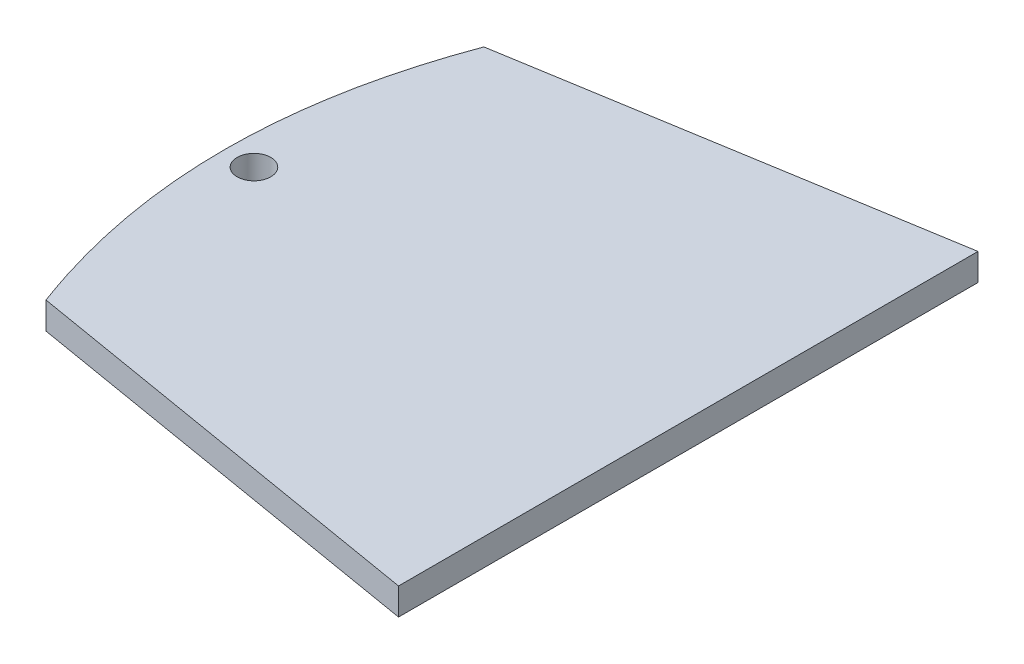
ISO-10303-21;
HEADER;
FILE_DESCRIPTION(('STEP AP214'),'2;1');
FILE_NAME('part.step','',(''),(''),'','','');
FILE_SCHEMA(('AUTOMOTIVE_DESIGN { 1 0 10303 214 1 1 1 1 }'));
ENDSEC;
DATA;
#1=APPLICATION_CONTEXT('core data for automotive mechanical design processes');
#2=APPLICATION_PROTOCOL_DEFINITION('international standard','automotive_design',2000,#1);
#3=PRODUCT_CONTEXT('',#1,'mechanical');
#4=PRODUCT('Part','Part','',(#3));
#5=PRODUCT_RELATED_PRODUCT_CATEGORY('part','',(#4));
#6=PRODUCT_DEFINITION_FORMATION('','',#4);
#7=PRODUCT_DEFINITION_CONTEXT('part definition',#1,'design');
#8=PRODUCT_DEFINITION('design','',#6,#7);
#9=PRODUCT_DEFINITION_SHAPE('','',#8);
#10=(LENGTH_UNIT() NAMED_UNIT(*) SI_UNIT(.MILLI.,.METRE.));
#11=(NAMED_UNIT(*) PLANE_ANGLE_UNIT() SI_UNIT($,.RADIAN.));
#12=(NAMED_UNIT(*) SI_UNIT($,.STERADIAN.) SOLID_ANGLE_UNIT());
#13=UNCERTAINTY_MEASURE_WITH_UNIT(LENGTH_MEASURE(1.E-05),#10,'distance_accuracy_value','');
#14=(GEOMETRIC_REPRESENTATION_CONTEXT(3) GLOBAL_UNCERTAINTY_ASSIGNED_CONTEXT((#13)) GLOBAL_UNIT_ASSIGNED_CONTEXT((#10,
#11,#12)) REPRESENTATION_CONTEXT('',''));
#15=CARTESIAN_POINT('',(0.,0.,0.));
#16=DIRECTION('',(0.,0.,1.));
#17=DIRECTION('',(1.,0.,0.));
#18=AXIS2_PLACEMENT_3D('',#15,#16,#17);
#19=CARTESIAN_POINT('',(-85.6517239552644,4.,-19.0315788004675));
#20=DIRECTION('',(0.,-1.,0.));
#21=DIRECTION('',(0.,0.,-1.));
#22=AXIS2_PLACEMENT_3D('',#19,#20,#21);
#23=PLANE('',#22);
#24=CARTESIAN_POINT('',(-79.6011786763253,4.,-51.5462335262357));
#25=CARTESIAN_POINT('',(-91.7198747328705,4.,-19.0283130118107));
#26=CARTESIAN_POINT('',(-79.5659676789912,4.,13.4765443479873));
#27=B_SPLINE_CURVE_WITH_KNOTS('',2,(#24,#25,#26),.UNSPECIFIED.,.F.,.F.,(3,3),(0.,1.),.UNSPECIFIED.);
#28=CARTESIAN_POINT('',(-79.6011786763253,4.,-51.5462335262357));
#29=VERTEX_POINT('',#28);
#30=CARTESIAN_POINT('',(-79.5659676789912,4.,13.4765443479873));
#31=VERTEX_POINT('',#30);
#32=EDGE_CURVE('E85',#29,#31,#27,.T.);
#33=ORIENTED_EDGE('',*,*,#32,.T.);
#34=DIRECTION('',(0.986116663206001,0.,0.16605398684603));
#35=VECTOR('',#34,1.);
#36=CARTESIAN_POINT('',(-16.6517245664483,4.,24.070788708764));
#37=LINE('',#36,#35);
#38=CARTESIAN_POINT('',(-16.6517245664483,4.,24.070788708764));
#39=VERTEX_POINT('',#38);
#40=EDGE_CURVE('E80',#31,#39,#37,.T.);
#41=ORIENTED_EDGE('',*,*,#40,.T.);
#42=DIRECTION('',(0.,0.,-1.));
#43=VECTOR('',#42,1.);
#44=CARTESIAN_POINT('',(-16.6517245664483,4.,-61.929211291236));
#45=LINE('',#44,#43);
#46=CARTESIAN_POINT('',(-16.6517245664483,4.,-61.929211291236));
#47=VERTEX_POINT('',#46);
#48=EDGE_CURVE('E83',#39,#47,#45,.T.);
#49=ORIENTED_EDGE('',*,*,#48,.T.);
#50=DIRECTION('',(-0.98666855971594,0.,0.162742598197496));
#51=VECTOR('',#50,1.);
#52=CARTESIAN_POINT('',(-79.6011786763253,4.,-51.5462335262357));
#53=LINE('',#52,#51);
#54=EDGE_CURVE('E50',#47,#29,#53,.T.);
#55=ORIENTED_EDGE('',*,*,#54,.T.);
#56=EDGE_LOOP('',(#33,#41,#49,#55));
#57=FACE_BOUND('',#56,.T.);
#58=CARTESIAN_POINT('',(-81.2125944381604,4.,-19.0327209291016));
#59=DIRECTION('',(0.,1.,0.));
#60=DIRECTION('',(0.,0.,1.));
#61=AXIS2_PLACEMENT_3D('',#58,#59,#60);
#62=CIRCLE('',#61,2.50000000000001);
#63=CARTESIAN_POINT('',(-81.2125944381604,4.,-16.5327209291016));
#64=VERTEX_POINT('',#63);
#65=EDGE_CURVE('E101',#64,#64,#62,.T.);
#66=ORIENTED_EDGE('',*,*,#65,.F.);
#67=EDGE_LOOP('',(#66));
#68=FACE_BOUND('',#67,.T.);
#69=ADVANCED_FACE('F32',(#57,#68),#23,.F.);
#70=CARTESIAN_POINT('',(-85.6517239552644,0.,-19.0315788004675));
#71=DIRECTION('',(0.,-1.,0.));
#72=DIRECTION('',(0.,0.,-1.));
#73=AXIS2_PLACEMENT_3D('',#70,#71,#72);
#74=PLANE('',#73);
#75=CARTESIAN_POINT('',(-79.6011786763253,0.,-51.5462335262357));
#76=CARTESIAN_POINT('',(-91.7198747328705,0.,-19.0283130118107));
#77=CARTESIAN_POINT('',(-79.5659676789912,0.,13.4765443479873));
#78=B_SPLINE_CURVE_WITH_KNOTS('',2,(#75,#76,#77),.UNSPECIFIED.,.F.,.F.,(3,3),(0.,1.),.UNSPECIFIED.);
#79=CARTESIAN_POINT('',(-79.6011786763253,0.,-51.5462335262357));
#80=VERTEX_POINT('',#79);
#81=CARTESIAN_POINT('',(-79.5659676789912,0.,13.4765443479873));
#82=VERTEX_POINT('',#81);
#83=EDGE_CURVE('E96',#80,#82,#78,.T.);
#84=ORIENTED_EDGE('',*,*,#83,.F.);
#85=DIRECTION('',(-0.98666855971594,0.,0.162742598197496));
#86=VECTOR('',#85,1.);
#87=CARTESIAN_POINT('',(-79.6011786763253,0.,-51.5462335262357));
#88=LINE('',#87,#86);
#89=CARTESIAN_POINT('',(-16.6517245664483,0.,-61.929211291236));
#90=VERTEX_POINT('',#89);
#91=EDGE_CURVE('E73',#90,#80,#88,.T.);
#92=ORIENTED_EDGE('',*,*,#91,.F.);
#93=DIRECTION('',(0.,0.,-1.));
#94=VECTOR('',#93,1.);
#95=CARTESIAN_POINT('',(-16.6517245664483,0.,-61.929211291236));
#96=LINE('',#95,#94);
#97=CARTESIAN_POINT('',(-16.6517245664483,0.,24.070788708764));
#98=VERTEX_POINT('',#97);
#99=EDGE_CURVE('E67',#98,#90,#96,.T.);
#100=ORIENTED_EDGE('',*,*,#99,.F.);
#101=DIRECTION('',(0.986116663206001,0.,0.16605398684603));
#102=VECTOR('',#101,1.);
#103=CARTESIAN_POINT('',(-16.6517245664483,0.,24.070788708764));
#104=LINE('',#103,#102);
#105=EDGE_CURVE('E89',#82,#98,#104,.T.);
#106=ORIENTED_EDGE('',*,*,#105,.F.);
#107=EDGE_LOOP('',(#84,#92,#100,#106));
#108=FACE_BOUND('',#107,.T.);
#109=CARTESIAN_POINT('',(-81.2125944381604,0.,-19.0327209291016));
#110=DIRECTION('',(0.,1.,0.));
#111=DIRECTION('',(0.,0.,1.));
#112=AXIS2_PLACEMENT_3D('',#109,#110,#111);
#113=CIRCLE('',#112,2.50000000000001);
#114=CARTESIAN_POINT('',(-81.2125944381604,0.,-16.5327209291016));
#115=VERTEX_POINT('',#114);
#116=EDGE_CURVE('E119',#115,#115,#113,.T.);
#117=ORIENTED_EDGE('',*,*,#116,.T.);
#118=EDGE_LOOP('',(#117));
#119=FACE_BOUND('',#118,.T.);
#120=ADVANCED_FACE('F112',(#108,#119),#74,.T.);
#121=DIRECTION('',(0.,-1.,0.));
#122=VECTOR('',#121,1.);
#123=SURFACE_OF_LINEAR_EXTRUSION('',#27,#122);
#124=ORIENTED_EDGE('',*,*,#83,.T.);
#125=DIRECTION('',(0.,-1.,0.));
#126=VECTOR('',#125,1.);
#127=CARTESIAN_POINT('',(-79.5659676789912,4.,13.4765443479873));
#128=LINE('',#127,#126);
#129=EDGE_CURVE('E11',#31,#82,#128,.T.);
#130=ORIENTED_EDGE('',*,*,#129,.F.);
#131=ORIENTED_EDGE('',*,*,#32,.F.);
#132=DIRECTION('',(0.,-1.,0.));
#133=VECTOR('',#132,1.);
#134=CARTESIAN_POINT('',(-79.6011786763253,4.,-51.5462335262357));
#135=LINE('',#134,#133);
#136=EDGE_CURVE('E93',#29,#80,#135,.T.);
#137=ORIENTED_EDGE('',*,*,#136,.T.);
#138=EDGE_LOOP('',(#124,#130,#131,#137));
#139=FACE_BOUND('',#138,.T.);
#140=ADVANCED_FACE('F34',(#139),#123,.F.);
#141=CARTESIAN_POINT('',(-16.6517245664483,4.,24.070788708764));
#142=DIRECTION('',(0.16605398684603,0.,-0.986116663206002));
#143=DIRECTION('',(-0.986116663206001,0.,-0.16605398684603));
#144=AXIS2_PLACEMENT_3D('',#141,#142,#143);
#145=PLANE('',#144);
#146=ORIENTED_EDGE('',*,*,#105,.T.);
#147=DIRECTION('',(0.,-1.,0.));
#148=VECTOR('',#147,1.);
#149=CARTESIAN_POINT('',(-16.6517245664483,4.,24.070788708764));
#150=LINE('',#149,#148);
#151=EDGE_CURVE('E42',#39,#98,#150,.T.);
#152=ORIENTED_EDGE('',*,*,#151,.F.);
#153=ORIENTED_EDGE('',*,*,#40,.F.);
#154=ORIENTED_EDGE('',*,*,#129,.T.);
#155=EDGE_LOOP('',(#146,#152,#153,#154));
#156=FACE_BOUND('',#155,.T.);
#157=ADVANCED_FACE('F88',(#156),#145,.F.);
#158=CARTESIAN_POINT('',(-16.6517245664483,4.,-61.929211291236));
#159=DIRECTION('',(-1.,0.,0.));
#160=DIRECTION('',(0.,0.,1.));
#161=AXIS2_PLACEMENT_3D('',#158,#159,#160);
#162=PLANE('',#161);
#163=ORIENTED_EDGE('',*,*,#99,.T.);
#164=DIRECTION('',(0.,-1.,0.));
#165=VECTOR('',#164,1.);
#166=CARTESIAN_POINT('',(-16.6517245664483,4.,-61.929211291236));
#167=LINE('',#166,#165);
#168=EDGE_CURVE('E90',#47,#90,#167,.T.);
#169=ORIENTED_EDGE('',*,*,#168,.F.);
#170=ORIENTED_EDGE('',*,*,#48,.F.);
#171=ORIENTED_EDGE('',*,*,#151,.T.);
#172=EDGE_LOOP('',(#163,#169,#170,#171));
#173=FACE_BOUND('',#172,.T.);
#174=ADVANCED_FACE('F91',(#173),#162,.F.);
#175=CARTESIAN_POINT('',(-79.6011786763253,4.,-51.5462335262357));
#176=DIRECTION('',(0.162742598197496,0.,0.98666855971594));
#177=DIRECTION('',(0.986668559715941,0.,-0.162742598197496));
#178=AXIS2_PLACEMENT_3D('',#175,#176,#177);
#179=PLANE('',#178);
#180=ORIENTED_EDGE('',*,*,#91,.T.);
#181=ORIENTED_EDGE('',*,*,#136,.F.);
#182=ORIENTED_EDGE('',*,*,#54,.F.);
#183=ORIENTED_EDGE('',*,*,#168,.T.);
#184=EDGE_LOOP('',(#180,#181,#182,#183));
#185=FACE_BOUND('',#184,.T.);
#186=ADVANCED_FACE('F109',(#185),#179,.F.);
#187=CARTESIAN_POINT('',(-81.2125944381604,4.,-19.0327209291016));
#188=DIRECTION('',(0.,-1.,0.));
#189=DIRECTION('',(0.,0.,-1.));
#190=AXIS2_PLACEMENT_3D('',#187,#188,#189);
#191=CYLINDRICAL_SURFACE('',#190,2.50000000000001);
#192=ORIENTED_EDGE('',*,*,#65,.T.);
#193=EDGE_LOOP('',(#192));
#194=FACE_BOUND('',#193,.T.);
#195=ORIENTED_EDGE('',*,*,#116,.F.);
#196=EDGE_LOOP('',(#195));
#197=FACE_BOUND('',#196,.T.);
#198=ADVANCED_FACE('F128',(#194,#197),#191,.F.);
#199=CLOSED_SHELL('',(#69,#120,#140,#157,#174,#186,#198));
#200=MANIFOLD_SOLID_BREP('B2',#199);
#201=ADVANCED_BREP_SHAPE_REPRESENTATION('',(#18,#200),#14);
#202=SHAPE_DEFINITION_REPRESENTATION(#9,#201);
ENDSEC;
END-ISO-10303-21;
